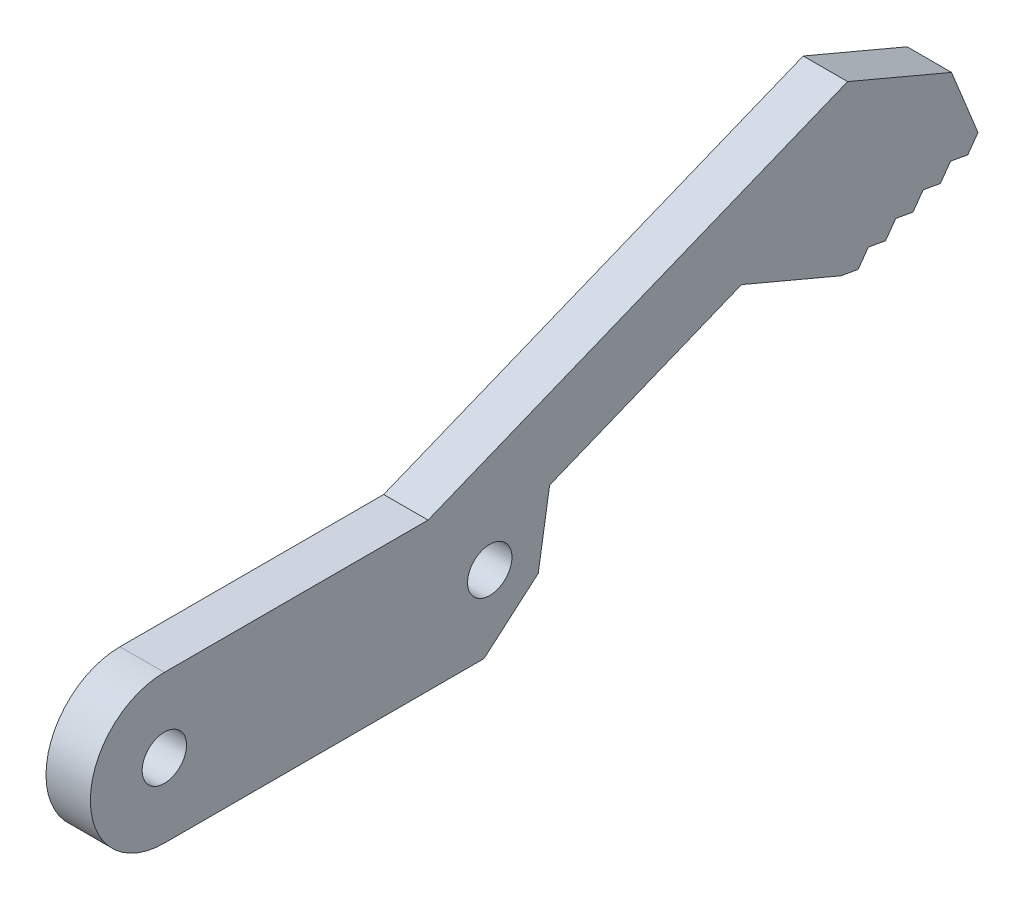
ISO-10303-21;
HEADER;
FILE_DESCRIPTION(('STEP AP214'),'2;1');
FILE_NAME('part.step','',(''),(''),'','','');
FILE_SCHEMA(('AUTOMOTIVE_DESIGN { 1 0 10303 214 1 1 1 1 }'));
ENDSEC;
DATA;
#1=APPLICATION_CONTEXT('core data for automotive mechanical design processes');
#2=APPLICATION_PROTOCOL_DEFINITION('international standard','automotive_design',2000,#1);
#3=PRODUCT_CONTEXT('',#1,'mechanical');
#4=PRODUCT('Part','Part','',(#3));
#5=PRODUCT_RELATED_PRODUCT_CATEGORY('part','',(#4));
#6=PRODUCT_DEFINITION_FORMATION('','',#4);
#7=PRODUCT_DEFINITION_CONTEXT('part definition',#1,'design');
#8=PRODUCT_DEFINITION('design','',#6,#7);
#9=PRODUCT_DEFINITION_SHAPE('','',#8);
#10=(LENGTH_UNIT() NAMED_UNIT(*) SI_UNIT(.MILLI.,.METRE.));
#11=(NAMED_UNIT(*) PLANE_ANGLE_UNIT() SI_UNIT($,.RADIAN.));
#12=(NAMED_UNIT(*) SI_UNIT($,.STERADIAN.) SOLID_ANGLE_UNIT());
#13=UNCERTAINTY_MEASURE_WITH_UNIT(LENGTH_MEASURE(1.E-05),#10,'distance_accuracy_value','');
#14=(GEOMETRIC_REPRESENTATION_CONTEXT(3) GLOBAL_UNCERTAINTY_ASSIGNED_CONTEXT((#13)) GLOBAL_UNIT_ASSIGNED_CONTEXT((#10,
#11,#12)) REPRESENTATION_CONTEXT('',''));
#15=CARTESIAN_POINT('',(0.,0.,0.));
#16=DIRECTION('',(0.,0.,1.));
#17=DIRECTION('',(1.,0.,0.));
#18=AXIS2_PLACEMENT_3D('',#15,#16,#17);
#19=CARTESIAN_POINT('',(1.5,0.,0.));
#20=DIRECTION('',(1.,0.,0.));
#21=DIRECTION('',(0.,0.,-1.));
#22=AXIS2_PLACEMENT_3D('',#19,#20,#21);
#23=PLANE('',#22);
#24=CARTESIAN_POINT('',(1.5,0.,-11.));
#25=DIRECTION('',(1.,0.,0.));
#26=DIRECTION('',(0.,0.,-1.));
#27=AXIS2_PLACEMENT_3D('',#24,#25,#26);
#28=CIRCLE('',#27,1.5);
#29=CARTESIAN_POINT('',(1.5,0.,-12.5));
#30=VERTEX_POINT('',#29);
#31=EDGE_CURVE('E136',#30,#30,#28,.T.);
#32=ORIENTED_EDGE('',*,*,#31,.F.);
#33=EDGE_LOOP('',(#32));
#34=FACE_BOUND('',#33,.T.);
#35=CARTESIAN_POINT('',(1.5,0.,11.));
#36=DIRECTION('',(1.,0.,0.));
#37=DIRECTION('',(0.,0.,-1.));
#38=AXIS2_PLACEMENT_3D('',#35,#36,#37);
#39=CIRCLE('',#38,1.5);
#40=CARTESIAN_POINT('',(1.5,0.,9.50000000000001));
#41=VERTEX_POINT('',#40);
#42=EDGE_CURVE('E107',#41,#41,#39,.T.);
#43=ORIENTED_EDGE('',*,*,#42,.F.);
#44=EDGE_LOOP('',(#43));
#45=FACE_BOUND('',#44,.T.);
#46=DIRECTION('',(0.,0.811746559900306,-0.584009865062243));
#47=VECTOR('',#46,1.);
#48=CARTESIAN_POINT('',(1.5,-17.1372740545539,-23.8200141676892));
#49=LINE('',#48,#47);
#50=CARTESIAN_POINT('',(1.5,7.39191676895877,-41.4675043211245));
#51=VERTEX_POINT('',#50);
#52=CARTESIAN_POINT('',(1.5,8.35132428291398,-42.1577486417576));
#53=VERTEX_POINT('',#52);
#54=EDGE_CURVE('E294',#51,#53,#49,.T.);
#55=ORIENTED_EDGE('',*,*,#54,.T.);
#56=DIRECTION('',(0.,-0.176310458660285,-0.984334608843456));
#57=VECTOR('',#56,1.);
#58=CARTESIAN_POINT('',(1.5,15.4081336773122,-2.7598492335221));
#59=LINE('',#58,#57);
#60=CARTESIAN_POINT('',(1.5,8.14294202768355,-43.3211388753874));
#61=VERTEX_POINT('',#60);
#62=EDGE_CURVE('E298',#53,#61,#59,.T.);
#63=ORIENTED_EDGE('',*,*,#62,.T.);
#64=DIRECTION('',(0.,0.811746559900309,-0.584009865062239));
#65=VECTOR('',#64,1.);
#66=CARTESIAN_POINT('',(1.5,-17.7598725540869,-24.6853971353918));
#67=LINE('',#66,#65);
#68=CARTESIAN_POINT('',(1.5,9.10234954163876,-44.0113831960205));
#69=VERTEX_POINT('',#68);
#70=EDGE_CURVE('E247',#61,#69,#67,.T.);
#71=ORIENTED_EDGE('',*,*,#70,.T.);
#72=DIRECTION('',(0.,0.926817277131445,0.375512629362388));
#73=VECTOR('',#72,1.);
#74=CARTESIAN_POINT('',(1.5,16.6008716845223,-40.9732549309526));
#75=LINE('',#74,#73);
#76=CARTESIAN_POINT('',(1.5,13.5184546570459,-42.2221381265287));
#77=VERTEX_POINT('',#76);
#78=EDGE_CURVE('E70',#69,#77,#75,.T.);
#79=ORIENTED_EDGE('',*,*,#78,.T.);
#80=DIRECTION('',(0.,-0.389831254937157,-0.920886308223834));
#81=VECTOR('',#80,1.);
#82=CARTESIAN_POINT('',(1.5,16.4926366310558,-35.1963201005385));
#83=LINE('',#82,#81);
#84=CARTESIAN_POINT('',(1.5,16.4926366310558,-35.1963201005385));
#85=VERTEX_POINT('',#84);
#86=EDGE_CURVE('E198',#85,#77,#83,.T.);
#87=ORIENTED_EDGE('',*,*,#86,.F.);
#88=DIRECTION('',(0.,0.375512629362387,-0.926817277131445));
#89=VECTOR('',#88,1.);
#90=CARTESIAN_POINT('',(1.5,1.91758297252369,0.776934830414033));
#91=LINE('',#90,#89);
#92=CARTESIAN_POINT('',(1.5,5.,-6.83089812380655));
#93=VERTEX_POINT('',#92);
#94=EDGE_CURVE('E181',#93,#85,#91,.T.);
#95=ORIENTED_EDGE('',*,*,#94,.F.);
#96=DIRECTION('',(0.,0.,-1.));
#97=VECTOR('',#96,1.);
#98=CARTESIAN_POINT('',(1.5,4.99999999999999,0.));
#99=LINE('',#98,#97);
#100=CARTESIAN_POINT('',(1.5,5.,11.));
#101=VERTEX_POINT('',#100);
#102=EDGE_CURVE('E122',#101,#93,#99,.T.);
#103=ORIENTED_EDGE('',*,*,#102,.F.);
#104=CARTESIAN_POINT('',(1.5,0.,11.));
#105=DIRECTION('',(1.,0.,0.));
#106=DIRECTION('',(0.,0.,-1.));
#107=AXIS2_PLACEMENT_3D('',#104,#105,#106);
#108=CIRCLE('',#107,5.);
#109=CARTESIAN_POINT('',(1.5,-5.,11.));
#110=VERTEX_POINT('',#109);
#111=EDGE_CURVE('E78',#101,#110,#108,.T.);
#112=ORIENTED_EDGE('',*,*,#111,.T.);
#113=DIRECTION('',(0.,0.,-1.));
#114=VECTOR('',#113,1.);
#115=CARTESIAN_POINT('',(1.5,-5.,0.));
#116=LINE('',#115,#114);
#117=CARTESIAN_POINT('',(1.5,-5.,-10.6103174919287));
#118=VERTEX_POINT('',#117);
#119=EDGE_CURVE('E106',#110,#118,#116,.T.);
#120=ORIENTED_EDGE('',*,*,#119,.T.);
#121=DIRECTION('',(0.,-0.652055247286905,0.758171454544164));
#122=VECTOR('',#121,1.);
#123=CARTESIAN_POINT('',(1.5,-8.11953898551642,-6.9831012092637));
#124=LINE('',#123,#122);
#125=CARTESIAN_POINT('',(1.5,-1.84405260313138,-14.2798673319224));
#126=VERTEX_POINT('',#125);
#127=EDGE_CURVE('E248',#126,#118,#124,.T.);
#128=ORIENTED_EDGE('',*,*,#127,.F.);
#129=DIRECTION('',(0.,-0.987317731643147,0.158756722008964));
#130=VECTOR('',#129,1.);
#131=CARTESIAN_POINT('',(1.5,-2.2847508524873,-14.209004825132));
#132=LINE('',#131,#130);
#133=CARTESIAN_POINT('',(1.5,2.93456521802145,-15.0482498664458));
#134=VERTEX_POINT('',#133);
#135=EDGE_CURVE('E252',#134,#126,#132,.T.);
#136=ORIENTED_EDGE('',*,*,#135,.F.);
#137=DIRECTION('',(0.,0.375512629362387,-0.926817277131445));
#138=VECTOR('',#137,1.);
#139=CARTESIAN_POINT('',(1.5,-2.71650341313353,-1.1006283163979));
#140=LINE('',#139,#138);
#141=CARTESIAN_POINT('',(1.5,8.19174202909487,-28.0236917462861));
#142=VERTEX_POINT('',#141);
#143=EDGE_CURVE('E156',#134,#142,#140,.T.);
#144=ORIENTED_EDGE('',*,*,#143,.T.);
#145=DIRECTION('',(0.,0.389831254937157,0.920886308223834));
#146=VECTOR('',#145,1.);
#147=CARTESIAN_POINT('',(1.5,17.0070885712925,-7.19947144546191));
#148=LINE('',#147,#146);
#149=CARTESIAN_POINT('',(1.5,5.34722324801487,-34.743210424706));
#150=VERTEX_POINT('',#149);
#151=EDGE_CURVE('E178',#150,#142,#148,.T.);
#152=ORIENTED_EDGE('',*,*,#151,.F.);
#153=DIRECTION('',(0.,-0.176310458660285,-0.984334608843456));
#154=VECTOR('',#153,1.);
#155=CARTESIAN_POINT('',(1.5,11.2106343735009,-2.00800832410744));
#156=LINE('',#155,#154);
#157=CARTESIAN_POINT('',(1.5,5.13884099278445,-35.9066006583358));
#158=VERTEX_POINT('',#157);
#159=EDGE_CURVE('E271',#150,#158,#156,.T.);
#160=ORIENTED_EDGE('',*,*,#159,.T.);
#161=DIRECTION('',(0.,0.811746559900309,-0.584009865062239));
#162=VECTOR('',#161,1.);
#163=CARTESIAN_POINT('',(1.5,-15.2694785559546,-21.223865264582));
#164=LINE('',#163,#162);
#165=CARTESIAN_POINT('',(1.5,6.09824850673965,-36.5968449789689));
#166=VERTEX_POINT('',#165);
#167=EDGE_CURVE('E232',#158,#166,#164,.T.);
#168=ORIENTED_EDGE('',*,*,#167,.T.);
#169=DIRECTION('',(0.,-0.176310458660285,-0.984334608843456));
#170=VECTOR('',#169,1.);
#171=CARTESIAN_POINT('',(1.5,12.2600091994537,-2.1959685514611));
#172=LINE('',#171,#170);
#173=CARTESIAN_POINT('',(1.5,5.88986625150922,-37.7602352125987));
#174=VERTEX_POINT('',#173);
#175=EDGE_CURVE('E210',#166,#174,#172,.T.);
#176=ORIENTED_EDGE('',*,*,#175,.T.);
#177=DIRECTION('',(0.,0.811746559900306,-0.584009865062243));
#178=VECTOR('',#177,1.);
#179=CARTESIAN_POINT('',(1.5,-15.8920770554877,-22.0892482322843));
#180=LINE('',#179,#178);
#181=CARTESIAN_POINT('',(1.5,6.84927376546443,-38.4504795332318));
#182=VERTEX_POINT('',#181);
#183=EDGE_CURVE('E272',#174,#182,#180,.T.);
#184=ORIENTED_EDGE('',*,*,#183,.T.);
#185=DIRECTION('',(0.,-0.176310458660286,-0.984334608843456));
#186=VECTOR('',#185,1.);
#187=CARTESIAN_POINT('',(1.5,13.3093840254066,-2.38392877881479));
#188=LINE('',#187,#186);
#189=CARTESIAN_POINT('',(1.5,6.640891510234,-39.6138697668616));
#190=VERTEX_POINT('',#189);
#191=EDGE_CURVE('E276',#182,#190,#188,.T.);
#192=ORIENTED_EDGE('',*,*,#191,.T.);
#193=DIRECTION('',(0.,0.811746559900306,-0.584009865062243));
#194=VECTOR('',#193,1.);
#195=CARTESIAN_POINT('',(1.5,-16.5146755550208,-22.9546311999867));
#196=LINE('',#195,#194);
#197=CARTESIAN_POINT('',(1.5,7.6002990241892,-40.3041140874947));
#198=VERTEX_POINT('',#197);
#199=EDGE_CURVE('E211',#190,#198,#196,.T.);
#200=ORIENTED_EDGE('',*,*,#199,.T.);
#201=DIRECTION('',(0.,-0.176310458660286,-0.984334608843456));
#202=VECTOR('',#201,1.);
#203=CARTESIAN_POINT('',(1.5,14.3587588513594,-2.57188900616846));
#204=LINE('',#203,#202);
#205=EDGE_CURVE('E215',#198,#51,#204,.T.);
#206=ORIENTED_EDGE('',*,*,#205,.T.);
#207=EDGE_LOOP('',(#55,#63,#71,#79,#87,#95,#103,#112,#120,#128,#136,#144,#152,#160,#168,#176,
#184,#192,#200,#206));
#208=FACE_BOUND('',#207,.T.);
#209=ADVANCED_FACE('F55',(#34,#45,#208),#23,.T.);
#210=CARTESIAN_POINT('',(-1.5,0.,0.));
#211=DIRECTION('',(1.,0.,0.));
#212=DIRECTION('',(0.,0.,-1.));
#213=AXIS2_PLACEMENT_3D('',#210,#211,#212);
#214=PLANE('',#213);
#215=CARTESIAN_POINT('',(-1.5,0.,-11.));
#216=DIRECTION('',(1.,0.,0.));
#217=DIRECTION('',(0.,0.,-1.));
#218=AXIS2_PLACEMENT_3D('',#215,#216,#217);
#219=CIRCLE('',#218,1.5);
#220=CARTESIAN_POINT('',(-1.5,0.,-12.5));
#221=VERTEX_POINT('',#220);
#222=EDGE_CURVE('E114',#221,#221,#219,.T.);
#223=ORIENTED_EDGE('',*,*,#222,.T.);
#224=EDGE_LOOP('',(#223));
#225=FACE_BOUND('',#224,.T.);
#226=CARTESIAN_POINT('',(-1.5,0.,11.));
#227=DIRECTION('',(1.,0.,0.));
#228=DIRECTION('',(0.,0.,-1.));
#229=AXIS2_PLACEMENT_3D('',#226,#227,#228);
#230=CIRCLE('',#229,1.5);
#231=CARTESIAN_POINT('',(-1.5,0.,9.50000000000001));
#232=VERTEX_POINT('',#231);
#233=EDGE_CURVE('E117',#232,#232,#230,.T.);
#234=ORIENTED_EDGE('',*,*,#233,.T.);
#235=EDGE_LOOP('',(#234));
#236=FACE_BOUND('',#235,.T.);
#237=DIRECTION('',(0.,-0.176310458660285,-0.984334608843456));
#238=VECTOR('',#237,1.);
#239=CARTESIAN_POINT('',(-1.5,15.4081336773122,-2.7598492335221));
#240=LINE('',#239,#238);
#241=CARTESIAN_POINT('',(-1.5,8.35132428291398,-42.1577486417576));
#242=VERTEX_POINT('',#241);
#243=CARTESIAN_POINT('',(-1.5,8.14294202768355,-43.3211388753874));
#244=VERTEX_POINT('',#243);
#245=EDGE_CURVE('E297',#242,#244,#240,.T.);
#246=ORIENTED_EDGE('',*,*,#245,.F.);
#247=DIRECTION('',(0.,0.811746559900306,-0.584009865062243));
#248=VECTOR('',#247,1.);
#249=CARTESIAN_POINT('',(-1.5,-17.1372740545539,-23.8200141676892));
#250=LINE('',#249,#248);
#251=CARTESIAN_POINT('',(-1.5,7.39191676895877,-41.4675043211245));
#252=VERTEX_POINT('',#251);
#253=EDGE_CURVE('E291',#252,#242,#250,.T.);
#254=ORIENTED_EDGE('',*,*,#253,.F.);
#255=DIRECTION('',(0.,-0.176310458660286,-0.984334608843456));
#256=VECTOR('',#255,1.);
#257=CARTESIAN_POINT('',(-1.5,14.3587588513594,-2.57188900616846));
#258=LINE('',#257,#256);
#259=CARTESIAN_POINT('',(-1.5,7.6002990241892,-40.3041140874947));
#260=VERTEX_POINT('',#259);
#261=EDGE_CURVE('E214',#260,#252,#258,.T.);
#262=ORIENTED_EDGE('',*,*,#261,.F.);
#263=DIRECTION('',(0.,0.811746559900306,-0.584009865062243));
#264=VECTOR('',#263,1.);
#265=CARTESIAN_POINT('',(-1.5,-16.5146755550208,-22.9546311999867));
#266=LINE('',#265,#264);
#267=CARTESIAN_POINT('',(-1.5,6.640891510234,-39.6138697668616));
#268=VERTEX_POINT('',#267);
#269=EDGE_CURVE('E207',#268,#260,#266,.T.);
#270=ORIENTED_EDGE('',*,*,#269,.F.);
#271=DIRECTION('',(0.,-0.176310458660286,-0.984334608843456));
#272=VECTOR('',#271,1.);
#273=CARTESIAN_POINT('',(-1.5,13.3093840254066,-2.38392877881479));
#274=LINE('',#273,#272);
#275=CARTESIAN_POINT('',(-1.5,6.84927376546443,-38.4504795332318));
#276=VERTEX_POINT('',#275);
#277=EDGE_CURVE('E275',#276,#268,#274,.T.);
#278=ORIENTED_EDGE('',*,*,#277,.F.);
#279=DIRECTION('',(0.,0.811746559900306,-0.584009865062243));
#280=VECTOR('',#279,1.);
#281=CARTESIAN_POINT('',(-1.5,-15.8920770554877,-22.0892482322843));
#282=LINE('',#281,#280);
#283=CARTESIAN_POINT('',(-1.5,5.88986625150922,-37.7602352125987));
#284=VERTEX_POINT('',#283);
#285=EDGE_CURVE('E268',#284,#276,#282,.T.);
#286=ORIENTED_EDGE('',*,*,#285,.F.);
#287=DIRECTION('',(0.,-0.176310458660285,-0.984334608843456));
#288=VECTOR('',#287,1.);
#289=CARTESIAN_POINT('',(-1.5,12.2600091994537,-2.1959685514611));
#290=LINE('',#289,#288);
#291=CARTESIAN_POINT('',(-1.5,6.09824850673965,-36.5968449789689));
#292=VERTEX_POINT('',#291);
#293=EDGE_CURVE('E235',#292,#284,#290,.T.);
#294=ORIENTED_EDGE('',*,*,#293,.F.);
#295=DIRECTION('',(0.,0.811746559900309,-0.584009865062239));
#296=VECTOR('',#295,1.);
#297=CARTESIAN_POINT('',(-1.5,-15.2694785559546,-21.223865264582));
#298=LINE('',#297,#296);
#299=CARTESIAN_POINT('',(-1.5,5.13884099278445,-35.9066006583358));
#300=VERTEX_POINT('',#299);
#301=EDGE_CURVE('E227',#300,#292,#298,.T.);
#302=ORIENTED_EDGE('',*,*,#301,.F.);
#303=DIRECTION('',(0.,-0.176310458660285,-0.984334608843456));
#304=VECTOR('',#303,1.);
#305=CARTESIAN_POINT('',(-1.5,11.2106343735009,-2.00800832410744));
#306=LINE('',#305,#304);
#307=CARTESIAN_POINT('',(-1.5,5.34722324801487,-34.743210424706));
#308=VERTEX_POINT('',#307);
#309=EDGE_CURVE('E255',#308,#300,#306,.T.);
#310=ORIENTED_EDGE('',*,*,#309,.F.);
#311=DIRECTION('',(0.,0.389831254937157,0.920886308223834));
#312=VECTOR('',#311,1.);
#313=CARTESIAN_POINT('',(-1.5,17.0070885712925,-7.19947144546191));
#314=LINE('',#313,#312);
#315=CARTESIAN_POINT('',(-1.5,8.19174202909487,-28.0236917462861));
#316=VERTEX_POINT('',#315);
#317=EDGE_CURVE('E185',#308,#316,#314,.T.);
#318=ORIENTED_EDGE('',*,*,#317,.T.);
#319=DIRECTION('',(0.,0.375512629362387,-0.926817277131445));
#320=VECTOR('',#319,1.);
#321=CARTESIAN_POINT('',(-1.5,-2.71650341313353,-1.1006283163979));
#322=LINE('',#321,#320);
#323=CARTESIAN_POINT('',(-1.5,2.93456521802145,-15.0482498664458));
#324=VERTEX_POINT('',#323);
#325=EDGE_CURVE('E164',#324,#316,#322,.T.);
#326=ORIENTED_EDGE('',*,*,#325,.F.);
#327=DIRECTION('',(0.,-0.987317731643147,0.158756722008964));
#328=VECTOR('',#327,1.);
#329=CARTESIAN_POINT('',(-1.5,-2.2847508524873,-14.209004825132));
#330=LINE('',#329,#328);
#331=CARTESIAN_POINT('',(-1.5,-1.84405260313138,-14.2798673319224));
#332=VERTEX_POINT('',#331);
#333=EDGE_CURVE('E251',#324,#332,#330,.T.);
#334=ORIENTED_EDGE('',*,*,#333,.T.);
#335=DIRECTION('',(0.,-0.652055247286905,0.758171454544164));
#336=VECTOR('',#335,1.);
#337=CARTESIAN_POINT('',(-1.5,-8.11953898551642,-6.9831012092637));
#338=LINE('',#337,#336);
#339=CARTESIAN_POINT('',(-1.5,-5.,-10.6103174919287));
#340=VERTEX_POINT('',#339);
#341=EDGE_CURVE('E113',#332,#340,#338,.T.);
#342=ORIENTED_EDGE('',*,*,#341,.T.);
#343=DIRECTION('',(0.,0.,-1.));
#344=VECTOR('',#343,1.);
#345=CARTESIAN_POINT('',(-1.5,-5.,0.));
#346=LINE('',#345,#344);
#347=CARTESIAN_POINT('',(-1.5,-5.,11.));
#348=VERTEX_POINT('',#347);
#349=EDGE_CURVE('E98',#348,#340,#346,.T.);
#350=ORIENTED_EDGE('',*,*,#349,.F.);
#351=CARTESIAN_POINT('',(-1.5,0.,11.));
#352=DIRECTION('',(1.,0.,0.));
#353=DIRECTION('',(0.,0.,-1.));
#354=AXIS2_PLACEMENT_3D('',#351,#352,#353);
#355=CIRCLE('',#354,5.);
#356=CARTESIAN_POINT('',(-1.5,5.,11.));
#357=VERTEX_POINT('',#356);
#358=EDGE_CURVE('E90',#357,#348,#355,.T.);
#359=ORIENTED_EDGE('',*,*,#358,.F.);
#360=DIRECTION('',(0.,0.,-1.));
#361=VECTOR('',#360,1.);
#362=CARTESIAN_POINT('',(-1.5,4.99999999999999,0.));
#363=LINE('',#362,#361);
#364=CARTESIAN_POINT('',(-1.5,5.,-6.83089812380655));
#365=VERTEX_POINT('',#364);
#366=EDGE_CURVE('E99',#357,#365,#363,.T.);
#367=ORIENTED_EDGE('',*,*,#366,.T.);
#368=DIRECTION('',(0.,0.375512629362387,-0.926817277131445));
#369=VECTOR('',#368,1.);
#370=CARTESIAN_POINT('',(-1.5,1.91758297252369,0.776934830414033));
#371=LINE('',#370,#369);
#372=CARTESIAN_POINT('',(-1.5,16.4926366310558,-35.1963201005385));
#373=VERTEX_POINT('',#372);
#374=EDGE_CURVE('E170',#365,#373,#371,.T.);
#375=ORIENTED_EDGE('',*,*,#374,.T.);
#376=DIRECTION('',(0.,-0.389831254937157,-0.920886308223834));
#377=VECTOR('',#376,1.);
#378=CARTESIAN_POINT('',(-1.5,16.4926366310558,-35.1963201005385));
#379=LINE('',#378,#377);
#380=CARTESIAN_POINT('',(-1.5,13.5184546570459,-42.2221381265287));
#381=VERTEX_POINT('',#380);
#382=EDGE_CURVE('E195',#373,#381,#379,.T.);
#383=ORIENTED_EDGE('',*,*,#382,.T.);
#384=DIRECTION('',(0.,0.926817277131445,0.375512629362388));
#385=VECTOR('',#384,1.);
#386=CARTESIAN_POINT('',(-1.5,16.6008716845223,-40.9732549309526));
#387=LINE('',#386,#385);
#388=CARTESIAN_POINT('',(-1.5,9.10234954163876,-44.0113831960205));
#389=VERTEX_POINT('',#388);
#390=EDGE_CURVE('E174',#389,#381,#387,.T.);
#391=ORIENTED_EDGE('',*,*,#390,.F.);
#392=DIRECTION('',(0.,0.811746559900309,-0.584009865062239));
#393=VECTOR('',#392,1.);
#394=CARTESIAN_POINT('',(-1.5,-17.7598725540869,-24.6853971353918));
#395=LINE('',#394,#393);
#396=EDGE_CURVE('E260',#244,#389,#395,.T.);
#397=ORIENTED_EDGE('',*,*,#396,.F.);
#398=EDGE_LOOP('',(#246,#254,#262,#270,#278,#286,#294,#302,#310,#318,#326,#334,#342,#350,#359,
#367,#375,#383,#391,#397));
#399=FACE_BOUND('',#398,.T.);
#400=ADVANCED_FACE('F110',(#225,#236,#399),#214,.F.);
#401=CARTESIAN_POINT('',(-1.5,16.6008716845223,-40.9732549309526));
#402=DIRECTION('',(0.,0.375512629362387,-0.926817277131445));
#403=DIRECTION('',(0.,0.926817277131445,0.375512629362388));
#404=AXIS2_PLACEMENT_3D('',#401,#402,#403);
#405=PLANE('',#404);
#406=ORIENTED_EDGE('',*,*,#78,.F.);
#407=DIRECTION('',(1.,0.,0.));
#408=VECTOR('',#407,1.);
#409=CARTESIAN_POINT('',(-1.5,9.10234954163876,-44.0113831960205));
#410=LINE('',#409,#408);
#411=EDGE_CURVE('E218',#389,#69,#410,.T.);
#412=ORIENTED_EDGE('',*,*,#411,.F.);
#413=ORIENTED_EDGE('',*,*,#390,.T.);
#414=DIRECTION('',(1.,0.,0.));
#415=VECTOR('',#414,1.);
#416=CARTESIAN_POINT('',(-1.5,13.5184546570459,-42.2221381265287));
#417=LINE('',#416,#415);
#418=EDGE_CURVE('E180',#381,#77,#417,.T.);
#419=ORIENTED_EDGE('',*,*,#418,.T.);
#420=EDGE_LOOP('',(#406,#412,#413,#419));
#421=FACE_BOUND('',#420,.T.);
#422=ADVANCED_FACE('F328',(#421),#405,.T.);
#423=CARTESIAN_POINT('',(1.5,4.99999999999999,0.));
#424=DIRECTION('',(0.,1.,0.));
#425=DIRECTION('',(0.,0.,1.));
#426=AXIS2_PLACEMENT_3D('',#423,#424,#425);
#427=PLANE('',#426);
#428=ORIENTED_EDGE('',*,*,#102,.T.);
#429=DIRECTION('',(1.,0.,0.));
#430=VECTOR('',#429,1.);
#431=CARTESIAN_POINT('',(-1.5,5.,-6.83089812380655));
#432=LINE('',#431,#430);
#433=EDGE_CURVE('E153',#365,#93,#432,.T.);
#434=ORIENTED_EDGE('',*,*,#433,.F.);
#435=ORIENTED_EDGE('',*,*,#366,.F.);
#436=DIRECTION('',(-1.,0.,0.));
#437=VECTOR('',#436,1.);
#438=CARTESIAN_POINT('',(1.5,5.,11.));
#439=LINE('',#438,#437);
#440=EDGE_CURVE('E12',#101,#357,#439,.T.);
#441=ORIENTED_EDGE('',*,*,#440,.F.);
#442=EDGE_LOOP('',(#428,#434,#435,#441));
#443=FACE_BOUND('',#442,.T.);
#444=ADVANCED_FACE('F57',(#443),#427,.T.);
#445=CARTESIAN_POINT('',(1.5,0.,11.));
#446=DIRECTION('',(-1.,0.,0.));
#447=DIRECTION('',(0.,0.,1.));
#448=AXIS2_PLACEMENT_3D('',#445,#446,#447);
#449=CYLINDRICAL_SURFACE('',#448,5.);
#450=ORIENTED_EDGE('',*,*,#358,.T.);
#451=DIRECTION('',(-1.,0.,0.));
#452=VECTOR('',#451,1.);
#453=CARTESIAN_POINT('',(1.5,-5.,11.));
#454=LINE('',#453,#452);
#455=EDGE_CURVE('E63',#110,#348,#454,.T.);
#456=ORIENTED_EDGE('',*,*,#455,.F.);
#457=ORIENTED_EDGE('',*,*,#111,.F.);
#458=ORIENTED_EDGE('',*,*,#440,.T.);
#459=EDGE_LOOP('',(#450,#456,#457,#458));
#460=FACE_BOUND('',#459,.T.);
#461=ADVANCED_FACE('F92',(#460),#449,.T.);
#462=CARTESIAN_POINT('',(1.5,-5.,0.));
#463=DIRECTION('',(0.,1.,0.));
#464=DIRECTION('',(0.,0.,1.));
#465=AXIS2_PLACEMENT_3D('',#462,#463,#464);
#466=PLANE('',#465);
#467=ORIENTED_EDGE('',*,*,#349,.T.);
#468=DIRECTION('',(1.,0.,0.));
#469=VECTOR('',#468,1.);
#470=CARTESIAN_POINT('',(-1.5,-5.,-10.6103174919287));
#471=LINE('',#470,#469);
#472=EDGE_CURVE('E245',#340,#118,#471,.T.);
#473=ORIENTED_EDGE('',*,*,#472,.T.);
#474=ORIENTED_EDGE('',*,*,#119,.F.);
#475=ORIENTED_EDGE('',*,*,#455,.T.);
#476=EDGE_LOOP('',(#467,#473,#474,#475));
#477=FACE_BOUND('',#476,.T.);
#478=ADVANCED_FACE('F103',(#477),#466,.F.);
#479=CARTESIAN_POINT('',(1.5,0.,-11.));
#480=DIRECTION('',(-1.,0.,0.));
#481=DIRECTION('',(0.,0.,1.));
#482=AXIS2_PLACEMENT_3D('',#479,#480,#481);
#483=CYLINDRICAL_SURFACE('',#482,1.5);
#484=ORIENTED_EDGE('',*,*,#31,.T.);
#485=EDGE_LOOP('',(#484));
#486=FACE_BOUND('',#485,.T.);
#487=ORIENTED_EDGE('',*,*,#222,.F.);
#488=EDGE_LOOP('',(#487));
#489=FACE_BOUND('',#488,.T.);
#490=ADVANCED_FACE('F448',(#486,#489),#483,.F.);
#491=CARTESIAN_POINT('',(1.5,0.,11.));
#492=DIRECTION('',(-1.,0.,0.));
#493=DIRECTION('',(0.,0.,1.));
#494=AXIS2_PLACEMENT_3D('',#491,#492,#493);
#495=CYLINDRICAL_SURFACE('',#494,1.5);
#496=ORIENTED_EDGE('',*,*,#42,.T.);
#497=EDGE_LOOP('',(#496));
#498=FACE_BOUND('',#497,.T.);
#499=ORIENTED_EDGE('',*,*,#233,.F.);
#500=EDGE_LOOP('',(#499));
#501=FACE_BOUND('',#500,.T.);
#502=ADVANCED_FACE('F445',(#498,#501),#495,.F.);
#503=CARTESIAN_POINT('',(-1.5,17.0070885712925,-7.19947144546191));
#504=DIRECTION('',(0.,0.920886308223834,-0.389831254937157));
#505=DIRECTION('',(0.,0.389831254937157,0.920886308223834));
#506=AXIS2_PLACEMENT_3D('',#503,#504,#505);
#507=PLANE('',#506);
#508=ORIENTED_EDGE('',*,*,#151,.T.);
#509=DIRECTION('',(1.,0.,0.));
#510=VECTOR('',#509,1.);
#511=CARTESIAN_POINT('',(-1.5,8.19174202909487,-28.0236917462861));
#512=LINE('',#511,#510);
#513=EDGE_CURVE('E140',#316,#142,#512,.T.);
#514=ORIENTED_EDGE('',*,*,#513,.F.);
#515=ORIENTED_EDGE('',*,*,#317,.F.);
#516=DIRECTION('',(1.,0.,0.));
#517=VECTOR('',#516,1.);
#518=CARTESIAN_POINT('',(-1.5,5.34722324801487,-34.743210424706));
#519=LINE('',#518,#517);
#520=EDGE_CURVE('E132',#308,#150,#519,.T.);
#521=ORIENTED_EDGE('',*,*,#520,.T.);
#522=EDGE_LOOP('',(#508,#514,#515,#521));
#523=FACE_BOUND('',#522,.T.);
#524=ADVANCED_FACE('F421',(#523),#507,.F.);
#525=CARTESIAN_POINT('',(-1.5,-2.71650341313353,-1.1006283163979));
#526=DIRECTION('',(0.,-0.926817277131445,-0.375512629362387));
#527=DIRECTION('',(0.,0.375512629362387,-0.926817277131445));
#528=AXIS2_PLACEMENT_3D('',#525,#526,#527);
#529=PLANE('',#528);
#530=ORIENTED_EDGE('',*,*,#143,.F.);
#531=DIRECTION('',(1.,0.,0.));
#532=VECTOR('',#531,1.);
#533=CARTESIAN_POINT('',(-1.5,2.93456521802145,-15.0482498664458));
#534=LINE('',#533,#532);
#535=EDGE_CURVE('E144',#324,#134,#534,.T.);
#536=ORIENTED_EDGE('',*,*,#535,.F.);
#537=ORIENTED_EDGE('',*,*,#325,.T.);
#538=ORIENTED_EDGE('',*,*,#513,.T.);
#539=EDGE_LOOP('',(#530,#536,#537,#538));
#540=FACE_BOUND('',#539,.T.);
#541=ADVANCED_FACE('F349',(#540),#529,.T.);
#542=CARTESIAN_POINT('',(-1.5,1.91758297252369,0.776934830414033));
#543=DIRECTION('',(0.,-0.926817277131445,-0.375512629362387));
#544=DIRECTION('',(0.,0.375512629362387,-0.926817277131445));
#545=AXIS2_PLACEMENT_3D('',#542,#543,#544);
#546=PLANE('',#545);
#547=ORIENTED_EDGE('',*,*,#94,.T.);
#548=DIRECTION('',(1.,0.,0.));
#549=VECTOR('',#548,1.);
#550=CARTESIAN_POINT('',(-1.5,16.4926366310558,-35.1963201005385));
#551=LINE('',#550,#549);
#552=EDGE_CURVE('E192',#373,#85,#551,.T.);
#553=ORIENTED_EDGE('',*,*,#552,.F.);
#554=ORIENTED_EDGE('',*,*,#374,.F.);
#555=ORIENTED_EDGE('',*,*,#433,.T.);
#556=EDGE_LOOP('',(#547,#553,#554,#555));
#557=FACE_BOUND('',#556,.T.);
#558=ADVANCED_FACE('F464',(#557),#546,.F.);
#559=CARTESIAN_POINT('',(-1.5,16.4926366310558,-35.1963201005385));
#560=DIRECTION('',(0.,-0.920886308223833,0.389831254937157));
#561=DIRECTION('',(0.,-0.389831254937157,-0.920886308223834));
#562=AXIS2_PLACEMENT_3D('',#559,#560,#561);
#563=PLANE('',#562);
#564=ORIENTED_EDGE('',*,*,#86,.T.);
#565=ORIENTED_EDGE('',*,*,#418,.F.);
#566=ORIENTED_EDGE('',*,*,#382,.F.);
#567=ORIENTED_EDGE('',*,*,#552,.T.);
#568=EDGE_LOOP('',(#564,#565,#566,#567));
#569=FACE_BOUND('',#568,.T.);
#570=ADVANCED_FACE('F332',(#569),#563,.F.);
#571=CARTESIAN_POINT('',(-1.5,12.2600091994537,-2.1959685514611));
#572=DIRECTION('',(0.,-0.984334608843456,0.176310458660285));
#573=DIRECTION('',(0.,-0.176310458660285,-0.984334608843456));
#574=AXIS2_PLACEMENT_3D('',#571,#572,#573);
#575=PLANE('',#574);
#576=ORIENTED_EDGE('',*,*,#175,.F.);
#577=DIRECTION('',(1.,0.,0.));
#578=VECTOR('',#577,1.);
#579=CARTESIAN_POINT('',(-1.5,6.09824850673965,-36.5968449789689));
#580=LINE('',#579,#578);
#581=EDGE_CURVE('E223',#292,#166,#580,.T.);
#582=ORIENTED_EDGE('',*,*,#581,.F.);
#583=ORIENTED_EDGE('',*,*,#293,.T.);
#584=DIRECTION('',(1.,0.,0.));
#585=VECTOR('',#584,1.);
#586=CARTESIAN_POINT('',(-1.5,5.88986625150922,-37.7602352125987));
#587=LINE('',#586,#585);
#588=EDGE_CURVE('E200',#284,#174,#587,.T.);
#589=ORIENTED_EDGE('',*,*,#588,.T.);
#590=EDGE_LOOP('',(#576,#582,#583,#589));
#591=FACE_BOUND('',#590,.T.);
#592=ADVANCED_FACE('F416',(#591),#575,.T.);
#593=CARTESIAN_POINT('',(-1.5,-15.2694785559546,-21.223865264582));
#594=DIRECTION('',(0.,-0.584009865062239,-0.811746559900309));
#595=DIRECTION('',(0.,0.811746559900309,-0.584009865062239));
#596=AXIS2_PLACEMENT_3D('',#593,#594,#595);
#597=PLANE('',#596);
#598=ORIENTED_EDGE('',*,*,#167,.F.);
#599=DIRECTION('',(1.,0.,0.));
#600=VECTOR('',#599,1.);
#601=CARTESIAN_POINT('',(-1.5,5.13884099278445,-35.9066006583358));
#602=LINE('',#601,#600);
#603=EDGE_CURVE('E226',#300,#158,#602,.T.);
#604=ORIENTED_EDGE('',*,*,#603,.F.);
#605=ORIENTED_EDGE('',*,*,#301,.T.);
#606=ORIENTED_EDGE('',*,*,#581,.T.);
#607=EDGE_LOOP('',(#598,#604,#605,#606));
#608=FACE_BOUND('',#607,.T.);
#609=ADVANCED_FACE('F419',(#608),#597,.T.);
#610=CARTESIAN_POINT('',(-1.5,14.3587588513594,-2.57188900616846));
#611=DIRECTION('',(0.,-0.984334608843456,0.176310458660286));
#612=DIRECTION('',(0.,-0.176310458660286,-0.984334608843456));
#613=AXIS2_PLACEMENT_3D('',#610,#611,#612);
#614=PLANE('',#613);
#615=ORIENTED_EDGE('',*,*,#205,.F.);
#616=DIRECTION('',(1.,0.,0.));
#617=VECTOR('',#616,1.);
#618=CARTESIAN_POINT('',(-1.5,7.6002990241892,-40.3041140874947));
#619=LINE('',#618,#617);
#620=EDGE_CURVE('E203',#260,#198,#619,.T.);
#621=ORIENTED_EDGE('',*,*,#620,.F.);
#622=ORIENTED_EDGE('',*,*,#261,.T.);
#623=DIRECTION('',(1.,0.,0.));
#624=VECTOR('',#623,1.);
#625=CARTESIAN_POINT('',(-1.5,7.39191676895877,-41.4675043211245));
#626=LINE('',#625,#624);
#627=EDGE_CURVE('E206',#252,#51,#626,.T.);
#628=ORIENTED_EDGE('',*,*,#627,.T.);
#629=EDGE_LOOP('',(#615,#621,#622,#628));
#630=FACE_BOUND('',#629,.T.);
#631=ADVANCED_FACE('F374',(#630),#614,.T.);
#632=CARTESIAN_POINT('',(-1.5,-16.5146755550208,-22.9546311999867));
#633=DIRECTION('',(0.,-0.584009865062243,-0.811746559900306));
#634=DIRECTION('',(0.,0.811746559900306,-0.584009865062243));
#635=AXIS2_PLACEMENT_3D('',#632,#633,#634);
#636=PLANE('',#635);
#637=ORIENTED_EDGE('',*,*,#199,.F.);
#638=DIRECTION('',(1.,0.,0.));
#639=VECTOR('',#638,1.);
#640=CARTESIAN_POINT('',(-1.5,6.640891510234,-39.6138697668616));
#641=LINE('',#640,#639);
#642=EDGE_CURVE('E267',#268,#190,#641,.T.);
#643=ORIENTED_EDGE('',*,*,#642,.F.);
#644=ORIENTED_EDGE('',*,*,#269,.T.);
#645=ORIENTED_EDGE('',*,*,#620,.T.);
#646=EDGE_LOOP('',(#637,#643,#644,#645));
#647=FACE_BOUND('',#646,.T.);
#648=ADVANCED_FACE('F368',(#647),#636,.T.);
#649=CARTESIAN_POINT('',(-1.5,-17.7598725540869,-24.6853971353918));
#650=DIRECTION('',(0.,-0.584009865062239,-0.811746559900309));
#651=DIRECTION('',(0.,0.811746559900309,-0.584009865062239));
#652=AXIS2_PLACEMENT_3D('',#649,#650,#651);
#653=PLANE('',#652);
#654=ORIENTED_EDGE('',*,*,#70,.F.);
#655=DIRECTION('',(1.,0.,0.));
#656=VECTOR('',#655,1.);
#657=CARTESIAN_POINT('',(-1.5,8.14294202768355,-43.3211388753874));
#658=LINE('',#657,#656);
#659=EDGE_CURVE('E279',#244,#61,#658,.T.);
#660=ORIENTED_EDGE('',*,*,#659,.F.);
#661=ORIENTED_EDGE('',*,*,#396,.T.);
#662=ORIENTED_EDGE('',*,*,#411,.T.);
#663=EDGE_LOOP('',(#654,#660,#661,#662));
#664=FACE_BOUND('',#663,.T.);
#665=ADVANCED_FACE('F319',(#664),#653,.T.);
#666=CARTESIAN_POINT('',(-1.5,-2.2847508524873,-14.209004825132));
#667=DIRECTION('',(0.,0.158756722008964,0.987317731643147));
#668=DIRECTION('',(0.,-0.987317731643147,0.158756722008964));
#669=AXIS2_PLACEMENT_3D('',#666,#667,#668);
#670=PLANE('',#669);
#671=ORIENTED_EDGE('',*,*,#135,.T.);
#672=DIRECTION('',(1.,0.,0.));
#673=VECTOR('',#672,1.);
#674=CARTESIAN_POINT('',(-1.5,-1.84405260313138,-14.2798673319224));
#675=LINE('',#674,#673);
#676=EDGE_CURVE('E242',#332,#126,#675,.T.);
#677=ORIENTED_EDGE('',*,*,#676,.F.);
#678=ORIENTED_EDGE('',*,*,#333,.F.);
#679=ORIENTED_EDGE('',*,*,#535,.T.);
#680=EDGE_LOOP('',(#671,#677,#678,#679));
#681=FACE_BOUND('',#680,.T.);
#682=ADVANCED_FACE('F346',(#681),#670,.F.);
#683=CARTESIAN_POINT('',(-1.5,-8.11953898551642,-6.9831012092637));
#684=DIRECTION('',(0.,0.758171454544164,0.652055247286905));
#685=DIRECTION('',(0.,-0.652055247286905,0.758171454544164));
#686=AXIS2_PLACEMENT_3D('',#683,#684,#685);
#687=PLANE('',#686);
#688=ORIENTED_EDGE('',*,*,#127,.T.);
#689=ORIENTED_EDGE('',*,*,#472,.F.);
#690=ORIENTED_EDGE('',*,*,#341,.F.);
#691=ORIENTED_EDGE('',*,*,#676,.T.);
#692=EDGE_LOOP('',(#688,#689,#690,#691));
#693=FACE_BOUND('',#692,.T.);
#694=ADVANCED_FACE('F481',(#693),#687,.F.);
#695=CARTESIAN_POINT('',(-1.5,13.3093840254066,-2.38392877881479));
#696=DIRECTION('',(0.,-0.984334608843456,0.176310458660286));
#697=DIRECTION('',(0.,-0.176310458660286,-0.984334608843456));
#698=AXIS2_PLACEMENT_3D('',#695,#696,#697);
#699=PLANE('',#698);
#700=ORIENTED_EDGE('',*,*,#191,.F.);
#701=DIRECTION('',(1.,0.,0.));
#702=VECTOR('',#701,1.);
#703=CARTESIAN_POINT('',(-1.5,6.84927376546443,-38.4504795332318));
#704=LINE('',#703,#702);
#705=EDGE_CURVE('E264',#276,#182,#704,.T.);
#706=ORIENTED_EDGE('',*,*,#705,.F.);
#707=ORIENTED_EDGE('',*,*,#277,.T.);
#708=ORIENTED_EDGE('',*,*,#642,.T.);
#709=EDGE_LOOP('',(#700,#706,#707,#708));
#710=FACE_BOUND('',#709,.T.);
#711=ADVANCED_FACE('F385',(#710),#699,.T.);
#712=CARTESIAN_POINT('',(-1.5,-15.8920770554877,-22.0892482322843));
#713=DIRECTION('',(0.,-0.584009865062243,-0.811746559900306));
#714=DIRECTION('',(0.,0.811746559900306,-0.584009865062243));
#715=AXIS2_PLACEMENT_3D('',#712,#713,#714);
#716=PLANE('',#715);
#717=ORIENTED_EDGE('',*,*,#183,.F.);
#718=ORIENTED_EDGE('',*,*,#588,.F.);
#719=ORIENTED_EDGE('',*,*,#285,.T.);
#720=ORIENTED_EDGE('',*,*,#705,.T.);
#721=EDGE_LOOP('',(#717,#718,#719,#720));
#722=FACE_BOUND('',#721,.T.);
#723=ADVANCED_FACE('F410',(#722),#716,.T.);
#724=CARTESIAN_POINT('',(-1.5,11.2106343735009,-2.00800832410744));
#725=DIRECTION('',(0.,-0.984334608843456,0.176310458660285));
#726=DIRECTION('',(0.,-0.176310458660285,-0.984334608843456));
#727=AXIS2_PLACEMENT_3D('',#724,#725,#726);
#728=PLANE('',#727);
#729=ORIENTED_EDGE('',*,*,#159,.F.);
#730=ORIENTED_EDGE('',*,*,#520,.F.);
#731=ORIENTED_EDGE('',*,*,#309,.T.);
#732=ORIENTED_EDGE('',*,*,#603,.T.);
#733=EDGE_LOOP('',(#729,#730,#731,#732));
#734=FACE_BOUND('',#733,.T.);
#735=ADVANCED_FACE('F422',(#734),#728,.T.);
#736=CARTESIAN_POINT('',(-1.5,15.4081336773122,-2.7598492335221));
#737=DIRECTION('',(0.,-0.984334608843456,0.176310458660285));
#738=DIRECTION('',(0.,-0.176310458660285,-0.984334608843456));
#739=AXIS2_PLACEMENT_3D('',#736,#737,#738);
#740=PLANE('',#739);
#741=ORIENTED_EDGE('',*,*,#62,.F.);
#742=DIRECTION('',(1.,0.,0.));
#743=VECTOR('',#742,1.);
#744=CARTESIAN_POINT('',(-1.5,8.35132428291398,-42.1577486417576));
#745=LINE('',#744,#743);
#746=EDGE_CURVE('E288',#242,#53,#745,.T.);
#747=ORIENTED_EDGE('',*,*,#746,.F.);
#748=ORIENTED_EDGE('',*,*,#245,.T.);
#749=ORIENTED_EDGE('',*,*,#659,.T.);
#750=EDGE_LOOP('',(#741,#747,#748,#749));
#751=FACE_BOUND('',#750,.T.);
#752=ADVANCED_FACE('F309',(#751),#740,.T.);
#753=CARTESIAN_POINT('',(-1.5,-17.1372740545539,-23.8200141676892));
#754=DIRECTION('',(0.,-0.584009865062243,-0.811746559900306));
#755=DIRECTION('',(0.,0.811746559900306,-0.584009865062243));
#756=AXIS2_PLACEMENT_3D('',#753,#754,#755);
#757=PLANE('',#756);
#758=ORIENTED_EDGE('',*,*,#54,.F.);
#759=ORIENTED_EDGE('',*,*,#627,.F.);
#760=ORIENTED_EDGE('',*,*,#253,.T.);
#761=ORIENTED_EDGE('',*,*,#746,.T.);
#762=EDGE_LOOP('',(#758,#759,#760,#761));
#763=FACE_BOUND('',#762,.T.);
#764=ADVANCED_FACE('F429',(#763),#757,.T.);
#765=CLOSED_SHELL('',(#209,#400,#422,#444,#461,#478,#490,#502,#524,#541,#558,#570,#592,#609,
#631,#648,#665,#682,#694,#711,#723,#735,#752,#764));
#766=MANIFOLD_SOLID_BREP('B2',#765);
#767=ADVANCED_BREP_SHAPE_REPRESENTATION('',(#18,#766),#14);
#768=SHAPE_DEFINITION_REPRESENTATION(#9,#767);
ENDSEC;
END-ISO-10303-21;
